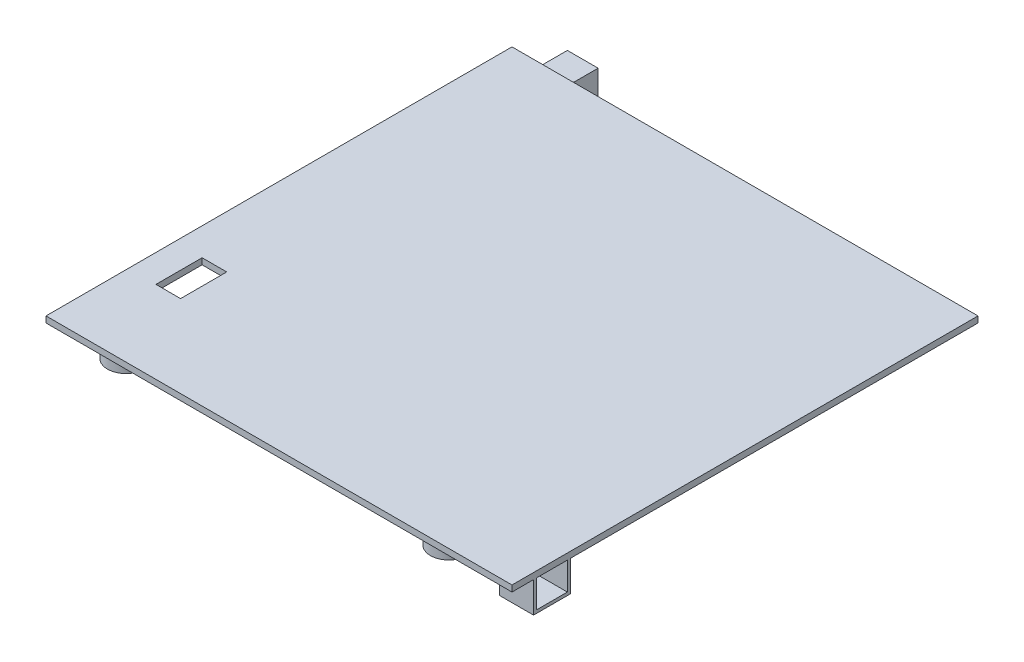
ISO-10303-21;
HEADER;
FILE_DESCRIPTION(('STEP AP214'),'2;1');
FILE_NAME('part.step','',(''),(''),'','','');
FILE_SCHEMA(('AUTOMOTIVE_DESIGN { 1 0 10303 214 1 1 1 1 }'));
ENDSEC;
DATA;
#1=APPLICATION_CONTEXT('core data for automotive mechanical design processes');
#2=APPLICATION_PROTOCOL_DEFINITION('international standard','automotive_design',2000,#1);
#3=PRODUCT_CONTEXT('',#1,'mechanical');
#4=PRODUCT('Part','Part','',(#3));
#5=PRODUCT_RELATED_PRODUCT_CATEGORY('part','',(#4));
#6=PRODUCT_DEFINITION_FORMATION('','',#4);
#7=PRODUCT_DEFINITION_CONTEXT('part definition',#1,'design');
#8=PRODUCT_DEFINITION('design','',#6,#7);
#9=PRODUCT_DEFINITION_SHAPE('','',#8);
#10=(LENGTH_UNIT() NAMED_UNIT(*) SI_UNIT(.MILLI.,.METRE.));
#11=(NAMED_UNIT(*) PLANE_ANGLE_UNIT() SI_UNIT($,.RADIAN.));
#12=(NAMED_UNIT(*) SI_UNIT($,.STERADIAN.) SOLID_ANGLE_UNIT());
#13=UNCERTAINTY_MEASURE_WITH_UNIT(LENGTH_MEASURE(1.E-05),#10,'distance_accuracy_value','');
#14=(GEOMETRIC_REPRESENTATION_CONTEXT(3) GLOBAL_UNCERTAINTY_ASSIGNED_CONTEXT((#13)) GLOBAL_UNIT_ASSIGNED_CONTEXT((#10,
#11,#12)) REPRESENTATION_CONTEXT('',''));
#15=CARTESIAN_POINT('',(0.,0.,0.));
#16=DIRECTION('',(0.,0.,1.));
#17=DIRECTION('',(1.,0.,0.));
#18=AXIS2_PLACEMENT_3D('',#15,#16,#17);
#19=CARTESIAN_POINT('',(0.,0.,0.));
#20=DIRECTION('',(0.,-1.,0.));
#21=DIRECTION('',(0.,0.,-1.));
#22=AXIS2_PLACEMENT_3D('',#19,#20,#21);
#23=PLANE('',#22);
#24=CARTESIAN_POINT('',(118.,0.,-13.));
#25=DIRECTION('',(0.,-1.,0.));
#26=DIRECTION('',(0.,0.,-1.));
#27=AXIS2_PLACEMENT_3D('',#24,#25,#26);
#28=CIRCLE('',#27,6.);
#29=CARTESIAN_POINT('',(118.,0.,-19.));
#30=VERTEX_POINT('',#29);
#31=EDGE_CURVE('E362',#30,#30,#28,.T.);
#32=ORIENTED_EDGE('',*,*,#31,.F.);
#33=EDGE_LOOP('',(#32));
#34=FACE_BOUND('',#33,.T.);
#35=CARTESIAN_POINT('',(13.,0.,-13.));
#36=DIRECTION('',(0.,-1.,0.));
#37=DIRECTION('',(0.,0.,-1.));
#38=AXIS2_PLACEMENT_3D('',#35,#36,#37);
#39=CIRCLE('',#38,6.);
#40=CARTESIAN_POINT('',(13.,0.,-19.));
#41=VERTEX_POINT('',#40);
#42=EDGE_CURVE('E394',#41,#41,#39,.T.);
#43=ORIENTED_EDGE('',*,*,#42,.F.);
#44=EDGE_LOOP('',(#43));
#45=FACE_BOUND('',#44,.T.);
#46=CARTESIAN_POINT('',(13.,0.,-118.));
#47=DIRECTION('',(0.,-1.,0.));
#48=DIRECTION('',(0.,0.,-1.));
#49=AXIS2_PLACEMENT_3D('',#46,#47,#48);
#50=CIRCLE('',#49,6.);
#51=CARTESIAN_POINT('',(13.,0.,-124.));
#52=VERTEX_POINT('',#51);
#53=EDGE_CURVE('E452',#52,#52,#50,.T.);
#54=ORIENTED_EDGE('',*,*,#53,.F.);
#55=EDGE_LOOP('',(#54));
#56=FACE_BOUND('',#55,.T.);
#57=CARTESIAN_POINT('',(118.,0.,-118.));
#58=DIRECTION('',(0.,-1.,0.));
#59=DIRECTION('',(0.,0.,-1.));
#60=AXIS2_PLACEMENT_3D('',#57,#58,#59);
#61=CIRCLE('',#60,6.);
#62=CARTESIAN_POINT('',(118.,0.,-124.));
#63=VERTEX_POINT('',#62);
#64=EDGE_CURVE('E460',#63,#63,#61,.T.);
#65=ORIENTED_EDGE('',*,*,#64,.F.);
#66=EDGE_LOOP('',(#65));
#67=FACE_BOUND('',#66,.T.);
#68=DIRECTION('',(0.,0.,-1.));
#69=VECTOR('',#68,1.);
#70=CARTESIAN_POINT('',(140.5,0.,-7.));
#71=LINE('',#70,#69);
#72=CARTESIAN_POINT('',(140.5,0.,-7.));
#73=VERTEX_POINT('',#72);
#74=CARTESIAN_POINT('',(140.5,0.,-19.));
#75=VERTEX_POINT('',#74);
#76=EDGE_CURVE('E292',#73,#75,#71,.T.);
#77=ORIENTED_EDGE('',*,*,#76,.F.);
#78=DIRECTION('',(-1.,0.,0.));
#79=VECTOR('',#78,1.);
#80=CARTESIAN_POINT('',(140.5,0.,-7.));
#81=LINE('',#80,#79);
#82=CARTESIAN_POINT('',(151.5,0.,-7.));
#83=VERTEX_POINT('',#82);
#84=EDGE_CURVE('E265',#83,#73,#81,.T.);
#85=ORIENTED_EDGE('',*,*,#84,.F.);
#86=DIRECTION('',(0.,0.,-1.));
#87=VECTOR('',#86,1.);
#88=CARTESIAN_POINT('',(151.5,0.,0.));
#89=LINE('',#88,#87);
#90=CARTESIAN_POINT('',(151.5,0.,0.));
#91=VERTEX_POINT('',#90);
#92=EDGE_CURVE('E428',#91,#83,#89,.T.);
#93=ORIENTED_EDGE('',*,*,#92,.F.);
#94=DIRECTION('',(1.,0.,0.));
#95=VECTOR('',#94,1.);
#96=CARTESIAN_POINT('',(0.,0.,0.));
#97=LINE('',#96,#95);
#98=CARTESIAN_POINT('',(0.,0.,0.));
#99=VERTEX_POINT('',#98);
#100=EDGE_CURVE('E424',#99,#91,#97,.T.);
#101=ORIENTED_EDGE('',*,*,#100,.F.);
#102=DIRECTION('',(0.,0.,1.));
#103=VECTOR('',#102,1.);
#104=CARTESIAN_POINT('',(0.,0.,0.));
#105=LINE('',#104,#103);
#106=CARTESIAN_POINT('',(0.,0.,-151.5));
#107=VERTEX_POINT('',#106);
#108=EDGE_CURVE('E402',#107,#99,#105,.T.);
#109=ORIENTED_EDGE('',*,*,#108,.F.);
#110=DIRECTION('',(-1.,0.,0.));
#111=VECTOR('',#110,1.);
#112=CARTESIAN_POINT('',(0.,0.,-151.5));
#113=LINE('',#112,#111);
#114=CARTESIAN_POINT('',(8.,0.,-151.5));
#115=VERTEX_POINT('',#114);
#116=EDGE_CURVE('E432',#115,#107,#113,.T.);
#117=ORIENTED_EDGE('',*,*,#116,.F.);
#118=DIRECTION('',(0.,0.,-1.));
#119=VECTOR('',#118,1.);
#120=CARTESIAN_POINT('',(8.00000000000003,0.,0.));
#121=LINE('',#120,#119);
#122=CARTESIAN_POINT('',(8.,0.,-141.5));
#123=VERTEX_POINT('',#122);
#124=EDGE_CURVE('E11',#123,#115,#121,.T.);
#125=ORIENTED_EDGE('',*,*,#124,.F.);
#126=DIRECTION('',(1.,0.,0.));
#127=VECTOR('',#126,1.);
#128=CARTESIAN_POINT('',(8.,0.,-141.5));
#129=LINE('',#128,#127);
#130=CARTESIAN_POINT('',(18.,0.,-141.5));
#131=VERTEX_POINT('',#130);
#132=EDGE_CURVE('E317',#123,#131,#129,.T.);
#133=ORIENTED_EDGE('',*,*,#132,.T.);
#134=DIRECTION('',(0.,0.,-1.));
#135=VECTOR('',#134,1.);
#136=CARTESIAN_POINT('',(18.,0.,-161.5));
#137=LINE('',#136,#135);
#138=CARTESIAN_POINT('',(18.,0.,-151.5));
#139=VERTEX_POINT('',#138);
#140=EDGE_CURVE('E330',#131,#139,#137,.T.);
#141=ORIENTED_EDGE('',*,*,#140,.T.);
#142=CARTESIAN_POINT('',(151.5,0.,-151.5));
#143=VERTEX_POINT('',#142);
#144=EDGE_CURVE('E411',#143,#139,#113,.T.);
#145=ORIENTED_EDGE('',*,*,#144,.F.);
#146=CARTESIAN_POINT('',(151.5,0.,-19.));
#147=VERTEX_POINT('',#146);
#148=EDGE_CURVE('E427',#147,#143,#89,.T.);
#149=ORIENTED_EDGE('',*,*,#148,.F.);
#150=DIRECTION('',(1.,0.,0.));
#151=VECTOR('',#150,1.);
#152=CARTESIAN_POINT('',(140.5,0.,-19.));
#153=LINE('',#152,#151);
#154=EDGE_CURVE('E280',#75,#147,#153,.T.);
#155=ORIENTED_EDGE('',*,*,#154,.F.);
#156=EDGE_LOOP('',(#77,#85,#93,#101,#109,#117,#125,#133,#141,#145,#149,#155));
#157=FACE_BOUND('',#156,.T.);
#158=DIRECTION('',(1.,0.,0.));
#159=VECTOR('',#158,1.);
#160=CARTESIAN_POINT('',(9.,0.,-26.75));
#161=LINE('',#160,#159);
#162=CARTESIAN_POINT('',(9.,0.,-26.75));
#163=VERTEX_POINT('',#162);
#164=CARTESIAN_POINT('',(17.,0.,-26.75));
#165=VERTEX_POINT('',#164);
#166=EDGE_CURVE('E192',#163,#165,#161,.T.);
#167=ORIENTED_EDGE('',*,*,#166,.T.);
#168=DIRECTION('',(0.,0.,-1.));
#169=VECTOR('',#168,1.);
#170=CARTESIAN_POINT('',(17.,0.,-26.75));
#171=LINE('',#170,#169);
#172=CARTESIAN_POINT('',(17.,0.,-41.75));
#173=VERTEX_POINT('',#172);
#174=EDGE_CURVE('E54',#165,#173,#171,.T.);
#175=ORIENTED_EDGE('',*,*,#174,.T.);
#176=DIRECTION('',(-1.,0.,0.));
#177=VECTOR('',#176,1.);
#178=CARTESIAN_POINT('',(9.,0.,-41.75));
#179=LINE('',#178,#177);
#180=CARTESIAN_POINT('',(9.,0.,-41.75));
#181=VERTEX_POINT('',#180);
#182=EDGE_CURVE('E198',#173,#181,#179,.T.);
#183=ORIENTED_EDGE('',*,*,#182,.T.);
#184=DIRECTION('',(0.,0.,1.));
#185=VECTOR('',#184,1.);
#186=CARTESIAN_POINT('',(9.,0.,-26.75));
#187=LINE('',#186,#185);
#188=EDGE_CURVE('E218',#181,#163,#187,.T.);
#189=ORIENTED_EDGE('',*,*,#188,.T.);
#190=EDGE_LOOP('',(#167,#175,#183,#189));
#191=FACE_BOUND('',#190,.T.);
#192=ADVANCED_FACE('F38',(#34,#45,#56,#67,#157,#191),#23,.T.);
#193=CARTESIAN_POINT('',(0.,2.,0.));
#194=DIRECTION('',(0.,-1.,0.));
#195=DIRECTION('',(0.,0.,-1.));
#196=AXIS2_PLACEMENT_3D('',#193,#194,#195);
#197=PLANE('',#196);
#198=DIRECTION('',(0.,0.,1.));
#199=VECTOR('',#198,1.);
#200=CARTESIAN_POINT('',(0.,2.,0.));
#201=LINE('',#200,#199);
#202=CARTESIAN_POINT('',(0.,2.,-151.5));
#203=VERTEX_POINT('',#202);
#204=CARTESIAN_POINT('',(0.,2.,0.));
#205=VERTEX_POINT('',#204);
#206=EDGE_CURVE('E406',#203,#205,#201,.T.);
#207=ORIENTED_EDGE('',*,*,#206,.T.);
#208=DIRECTION('',(1.,0.,0.));
#209=VECTOR('',#208,1.);
#210=CARTESIAN_POINT('',(0.,2.,0.));
#211=LINE('',#210,#209);
#212=CARTESIAN_POINT('',(151.5,2.,0.));
#213=VERTEX_POINT('',#212);
#214=EDGE_CURVE('E410',#205,#213,#211,.T.);
#215=ORIENTED_EDGE('',*,*,#214,.T.);
#216=DIRECTION('',(0.,0.,-1.));
#217=VECTOR('',#216,1.);
#218=CARTESIAN_POINT('',(151.5,2.,0.));
#219=LINE('',#218,#217);
#220=CARTESIAN_POINT('',(151.5,2.,-151.5));
#221=VERTEX_POINT('',#220);
#222=EDGE_CURVE('E414',#213,#221,#219,.T.);
#223=ORIENTED_EDGE('',*,*,#222,.T.);
#224=DIRECTION('',(-1.,0.,0.));
#225=VECTOR('',#224,1.);
#226=CARTESIAN_POINT('',(0.,2.,-151.5));
#227=LINE('',#226,#225);
#228=EDGE_CURVE('E417',#221,#203,#227,.T.);
#229=ORIENTED_EDGE('',*,*,#228,.T.);
#230=EDGE_LOOP('',(#207,#215,#223,#229));
#231=FACE_BOUND('',#230,.T.);
#232=DIRECTION('',(0.,0.,-1.));
#233=VECTOR('',#232,1.);
#234=CARTESIAN_POINT('',(17.,2.,-26.75));
#235=LINE('',#234,#233);
#236=CARTESIAN_POINT('',(17.,2.,-26.75));
#237=VERTEX_POINT('',#236);
#238=CARTESIAN_POINT('',(17.,2.,-41.75));
#239=VERTEX_POINT('',#238);
#240=EDGE_CURVE('E182',#237,#239,#235,.T.);
#241=ORIENTED_EDGE('',*,*,#240,.F.);
#242=DIRECTION('',(1.,0.,0.));
#243=VECTOR('',#242,1.);
#244=CARTESIAN_POINT('',(9.,2.,-26.75));
#245=LINE('',#244,#243);
#246=CARTESIAN_POINT('',(9.,2.,-26.75));
#247=VERTEX_POINT('',#246);
#248=EDGE_CURVE('E209',#247,#237,#245,.T.);
#249=ORIENTED_EDGE('',*,*,#248,.F.);
#250=DIRECTION('',(0.,0.,1.));
#251=VECTOR('',#250,1.);
#252=CARTESIAN_POINT('',(9.,2.,-26.75));
#253=LINE('',#252,#251);
#254=CARTESIAN_POINT('',(9.,2.,-41.75));
#255=VERTEX_POINT('',#254);
#256=EDGE_CURVE('E205',#255,#247,#253,.T.);
#257=ORIENTED_EDGE('',*,*,#256,.F.);
#258=DIRECTION('',(-1.,0.,0.));
#259=VECTOR('',#258,1.);
#260=CARTESIAN_POINT('',(9.,2.,-41.75));
#261=LINE('',#260,#259);
#262=EDGE_CURVE('E191',#239,#255,#261,.T.);
#263=ORIENTED_EDGE('',*,*,#262,.F.);
#264=EDGE_LOOP('',(#241,#249,#257,#263));
#265=FACE_BOUND('',#264,.T.);
#266=ADVANCED_FACE('F204',(#231,#265),#197,.F.);
#267=CARTESIAN_POINT('',(118.,-10.,-118.));
#268=DIRECTION('',(0.,-1.,0.));
#269=DIRECTION('',(0.,0.,-1.));
#270=AXIS2_PLACEMENT_3D('',#267,#268,#269);
#271=PLANE('',#270);
#272=CARTESIAN_POINT('',(118.,-10.,-118.));
#273=DIRECTION('',(0.,1.,0.));
#274=DIRECTION('',(0.,0.,1.));
#275=AXIS2_PLACEMENT_3D('',#272,#273,#274);
#276=CIRCLE('',#275,5.);
#277=CARTESIAN_POINT('',(118.,-10.,-113.));
#278=VERTEX_POINT('',#277);
#279=EDGE_CURVE('E375',#278,#278,#276,.T.);
#280=ORIENTED_EDGE('',*,*,#279,.T.);
#281=EDGE_LOOP('',(#280));
#282=FACE_BOUND('',#281,.T.);
#283=CARTESIAN_POINT('',(118.,-10.,-118.));
#284=DIRECTION('',(0.,-1.,0.));
#285=DIRECTION('',(0.,0.,-1.));
#286=AXIS2_PLACEMENT_3D('',#283,#284,#285);
#287=CIRCLE('',#286,6.);
#288=CARTESIAN_POINT('',(118.,-10.,-124.));
#289=VERTEX_POINT('',#288);
#290=EDGE_CURVE('E47',#289,#289,#287,.T.);
#291=ORIENTED_EDGE('',*,*,#290,.T.);
#292=EDGE_LOOP('',(#291));
#293=FACE_BOUND('',#292,.T.);
#294=ADVANCED_FACE('F40',(#282,#293),#271,.T.);
#295=CARTESIAN_POINT('',(118.,-10.,-118.));
#296=DIRECTION('',(0.,1.,0.));
#297=DIRECTION('',(0.,0.,1.));
#298=AXIS2_PLACEMENT_3D('',#295,#296,#297);
#299=CYLINDRICAL_SURFACE('',#298,6.);
#300=ORIENTED_EDGE('',*,*,#290,.F.);
#301=EDGE_LOOP('',(#300));
#302=FACE_BOUND('',#301,.T.);
#303=ORIENTED_EDGE('',*,*,#64,.T.);
#304=EDGE_LOOP('',(#303));
#305=FACE_BOUND('',#304,.T.);
#306=ADVANCED_FACE('F468',(#302,#305),#299,.T.);
#307=CARTESIAN_POINT('',(13.,-10.,-118.));
#308=DIRECTION('',(0.,-1.,0.));
#309=DIRECTION('',(0.,0.,-1.));
#310=AXIS2_PLACEMENT_3D('',#307,#308,#309);
#311=PLANE('',#310);
#312=CARTESIAN_POINT('',(13.,-10.,-118.));
#313=DIRECTION('',(0.,1.,0.));
#314=DIRECTION('',(0.,0.,1.));
#315=AXIS2_PLACEMENT_3D('',#312,#313,#314);
#316=CIRCLE('',#315,5.);
#317=CARTESIAN_POINT('',(13.,-10.,-113.));
#318=VERTEX_POINT('',#317);
#319=EDGE_CURVE('E358',#318,#318,#316,.T.);
#320=ORIENTED_EDGE('',*,*,#319,.T.);
#321=EDGE_LOOP('',(#320));
#322=FACE_BOUND('',#321,.T.);
#323=CARTESIAN_POINT('',(13.,-10.,-118.));
#324=DIRECTION('',(0.,-1.,0.));
#325=DIRECTION('',(0.,0.,-1.));
#326=AXIS2_PLACEMENT_3D('',#323,#324,#325);
#327=CIRCLE('',#326,6.);
#328=CARTESIAN_POINT('',(13.,-10.,-124.));
#329=VERTEX_POINT('',#328);
#330=EDGE_CURVE('E456',#329,#329,#327,.T.);
#331=ORIENTED_EDGE('',*,*,#330,.T.);
#332=EDGE_LOOP('',(#331));
#333=FACE_BOUND('',#332,.T.);
#334=ADVANCED_FACE('F471',(#322,#333),#311,.T.);
#335=CARTESIAN_POINT('',(13.,-10.,-118.));
#336=DIRECTION('',(0.,1.,0.));
#337=DIRECTION('',(0.,0.,1.));
#338=AXIS2_PLACEMENT_3D('',#335,#336,#337);
#339=CYLINDRICAL_SURFACE('',#338,6.);
#340=ORIENTED_EDGE('',*,*,#330,.F.);
#341=EDGE_LOOP('',(#340));
#342=FACE_BOUND('',#341,.T.);
#343=ORIENTED_EDGE('',*,*,#53,.T.);
#344=EDGE_LOOP('',(#343));
#345=FACE_BOUND('',#344,.T.);
#346=ADVANCED_FACE('F623',(#342,#345),#339,.T.);
#347=CARTESIAN_POINT('',(0.,2.,0.));
#348=DIRECTION('',(1.,0.,0.));
#349=DIRECTION('',(0.,0.,-1.));
#350=AXIS2_PLACEMENT_3D('',#347,#348,#349);
#351=PLANE('',#350);
#352=ORIENTED_EDGE('',*,*,#108,.T.);
#353=DIRECTION('',(0.,-1.,0.));
#354=VECTOR('',#353,1.);
#355=CARTESIAN_POINT('',(0.,2.,0.));
#356=LINE('',#355,#354);
#357=EDGE_CURVE('E448',#205,#99,#356,.T.);
#358=ORIENTED_EDGE('',*,*,#357,.F.);
#359=ORIENTED_EDGE('',*,*,#206,.F.);
#360=DIRECTION('',(0.,-1.,0.));
#361=VECTOR('',#360,1.);
#362=CARTESIAN_POINT('',(0.,2.,-151.5));
#363=LINE('',#362,#361);
#364=EDGE_CURVE('E420',#203,#107,#363,.T.);
#365=ORIENTED_EDGE('',*,*,#364,.T.);
#366=EDGE_LOOP('',(#352,#358,#359,#365));
#367=FACE_BOUND('',#366,.T.);
#368=ADVANCED_FACE('F619',(#367),#351,.F.);
#369=CARTESIAN_POINT('',(0.,2.,0.));
#370=DIRECTION('',(0.,0.,-1.));
#371=DIRECTION('',(-1.,0.,0.));
#372=AXIS2_PLACEMENT_3D('',#369,#370,#371);
#373=PLANE('',#372);
#374=ORIENTED_EDGE('',*,*,#100,.T.);
#375=DIRECTION('',(0.,-1.,0.));
#376=VECTOR('',#375,1.);
#377=CARTESIAN_POINT('',(151.5,2.,0.));
#378=LINE('',#377,#376);
#379=EDGE_CURVE('E444',#213,#91,#378,.T.);
#380=ORIENTED_EDGE('',*,*,#379,.F.);
#381=ORIENTED_EDGE('',*,*,#214,.F.);
#382=ORIENTED_EDGE('',*,*,#357,.T.);
#383=EDGE_LOOP('',(#374,#380,#381,#382));
#384=FACE_BOUND('',#383,.T.);
#385=ADVANCED_FACE('F615',(#384),#373,.F.);
#386=CARTESIAN_POINT('',(151.5,2.,0.));
#387=DIRECTION('',(-1.,0.,0.));
#388=DIRECTION('',(0.,0.,1.));
#389=AXIS2_PLACEMENT_3D('',#386,#387,#388);
#390=PLANE('',#389);
#391=DIRECTION('',(0.,0.,1.));
#392=VECTOR('',#391,1.);
#393=CARTESIAN_POINT('',(151.5,0.,-8.));
#394=LINE('',#393,#392);
#395=CARTESIAN_POINT('',(151.5,0.,-18.));
#396=VERTEX_POINT('',#395);
#397=CARTESIAN_POINT('',(151.5,0.,-8.));
#398=VERTEX_POINT('',#397);
#399=EDGE_CURVE('E251',#396,#398,#394,.T.);
#400=ORIENTED_EDGE('',*,*,#399,.F.);
#401=DIRECTION('',(0.,1.,0.));
#402=VECTOR('',#401,1.);
#403=CARTESIAN_POINT('',(151.5,0.,-18.));
#404=LINE('',#403,#402);
#405=CARTESIAN_POINT('',(151.5,-9.,-18.));
#406=VERTEX_POINT('',#405);
#407=EDGE_CURVE('E200',#406,#396,#404,.T.);
#408=ORIENTED_EDGE('',*,*,#407,.F.);
#409=DIRECTION('',(0.,0.,-1.));
#410=VECTOR('',#409,1.);
#411=CARTESIAN_POINT('',(151.5,-9.,-8.));
#412=LINE('',#411,#410);
#413=CARTESIAN_POINT('',(151.5,-9.,-8.));
#414=VERTEX_POINT('',#413);
#415=EDGE_CURVE('E236',#414,#406,#412,.T.);
#416=ORIENTED_EDGE('',*,*,#415,.F.);
#417=DIRECTION('',(0.,-1.,0.));
#418=VECTOR('',#417,1.);
#419=CARTESIAN_POINT('',(151.5,0.,-8.));
#420=LINE('',#419,#418);
#421=EDGE_CURVE('E255',#398,#414,#420,.T.);
#422=ORIENTED_EDGE('',*,*,#421,.F.);
#423=EDGE_LOOP('',(#400,#408,#416,#422));
#424=FACE_BOUND('',#423,.T.);
#425=ORIENTED_EDGE('',*,*,#92,.T.);
#426=DIRECTION('',(0.,1.,0.));
#427=VECTOR('',#426,1.);
#428=CARTESIAN_POINT('',(151.5,-10.,-7.));
#429=LINE('',#428,#427);
#430=CARTESIAN_POINT('',(151.5,-10.,-7.));
#431=VERTEX_POINT('',#430);
#432=EDGE_CURVE('E308',#431,#83,#429,.T.);
#433=ORIENTED_EDGE('',*,*,#432,.F.);
#434=DIRECTION('',(0.,0.,1.));
#435=VECTOR('',#434,1.);
#436=CARTESIAN_POINT('',(151.5,-10.,-7.));
#437=LINE('',#436,#435);
#438=CARTESIAN_POINT('',(151.5,-10.,-19.));
#439=VERTEX_POINT('',#438);
#440=EDGE_CURVE('E275',#439,#431,#437,.T.);
#441=ORIENTED_EDGE('',*,*,#440,.F.);
#442=DIRECTION('',(0.,1.,0.));
#443=VECTOR('',#442,1.);
#444=CARTESIAN_POINT('',(151.5,-10.,-19.));
#445=LINE('',#444,#443);
#446=EDGE_CURVE('E289',#439,#147,#445,.T.);
#447=ORIENTED_EDGE('',*,*,#446,.T.);
#448=ORIENTED_EDGE('',*,*,#148,.T.);
#449=DIRECTION('',(0.,-1.,0.));
#450=VECTOR('',#449,1.);
#451=CARTESIAN_POINT('',(151.5,2.,-151.5));
#452=LINE('',#451,#450);
#453=EDGE_CURVE('E440',#221,#143,#452,.T.);
#454=ORIENTED_EDGE('',*,*,#453,.F.);
#455=ORIENTED_EDGE('',*,*,#222,.F.);
#456=ORIENTED_EDGE('',*,*,#379,.T.);
#457=EDGE_LOOP('',(#425,#433,#441,#447,#448,#454,#455,#456));
#458=FACE_BOUND('',#457,.T.);
#459=ADVANCED_FACE('F611',(#424,#458),#390,.F.);
#460=CARTESIAN_POINT('',(0.,2.,-151.5));
#461=DIRECTION('',(0.,0.,1.));
#462=DIRECTION('',(1.,0.,0.));
#463=AXIS2_PLACEMENT_3D('',#460,#461,#462);
#464=PLANE('',#463);
#465=ORIENTED_EDGE('',*,*,#144,.T.);
#466=EDGE_CURVE('E436',#139,#115,#113,.T.);
#467=ORIENTED_EDGE('',*,*,#466,.T.);
#468=ORIENTED_EDGE('',*,*,#116,.T.);
#469=ORIENTED_EDGE('',*,*,#364,.F.);
#470=ORIENTED_EDGE('',*,*,#228,.F.);
#471=ORIENTED_EDGE('',*,*,#453,.T.);
#472=EDGE_LOOP('',(#465,#467,#468,#469,#470,#471));
#473=FACE_BOUND('',#472,.T.);
#474=ADVANCED_FACE('F604',(#473),#464,.F.);
#475=CARTESIAN_POINT('',(13.,-10.,-13.));
#476=DIRECTION('',(0.,1.,0.));
#477=DIRECTION('',(0.,0.,1.));
#478=AXIS2_PLACEMENT_3D('',#475,#476,#477);
#479=CYLINDRICAL_SURFACE('',#478,6.);
#480=CARTESIAN_POINT('',(13.,-10.,-13.));
#481=DIRECTION('',(0.,-1.,0.));
#482=DIRECTION('',(0.,0.,-1.));
#483=AXIS2_PLACEMENT_3D('',#480,#481,#482);
#484=CIRCLE('',#483,6.);
#485=CARTESIAN_POINT('',(13.,-10.,-19.));
#486=VERTEX_POINT('',#485);
#487=EDGE_CURVE('E398',#486,#486,#484,.T.);
#488=ORIENTED_EDGE('',*,*,#487,.F.);
#489=EDGE_LOOP('',(#488));
#490=FACE_BOUND('',#489,.T.);
#491=ORIENTED_EDGE('',*,*,#42,.T.);
#492=EDGE_LOOP('',(#491));
#493=FACE_BOUND('',#492,.T.);
#494=ADVANCED_FACE('F600',(#490,#493),#479,.T.);
#495=CARTESIAN_POINT('',(13.,-10.,-13.));
#496=DIRECTION('',(0.,-1.,0.));
#497=DIRECTION('',(0.,0.,-1.));
#498=AXIS2_PLACEMENT_3D('',#495,#496,#497);
#499=PLANE('',#498);
#500=CARTESIAN_POINT('',(13.,-10.,-13.));
#501=DIRECTION('',(0.,1.,0.));
#502=DIRECTION('',(0.,0.,1.));
#503=AXIS2_PLACEMENT_3D('',#500,#501,#502);
#504=CIRCLE('',#503,5.);
#505=CARTESIAN_POINT('',(13.,-10.,-8.));
#506=VERTEX_POINT('',#505);
#507=EDGE_CURVE('E390',#506,#506,#504,.T.);
#508=ORIENTED_EDGE('',*,*,#507,.T.);
#509=EDGE_LOOP('',(#508));
#510=FACE_BOUND('',#509,.T.);
#511=ORIENTED_EDGE('',*,*,#487,.T.);
#512=EDGE_LOOP('',(#511));
#513=FACE_BOUND('',#512,.T.);
#514=ADVANCED_FACE('F596',(#510,#513),#499,.T.);
#515=CARTESIAN_POINT('',(13.,-10.,-13.));
#516=DIRECTION('',(0.,1.,0.));
#517=DIRECTION('',(0.,0.,1.));
#518=AXIS2_PLACEMENT_3D('',#515,#516,#517);
#519=CYLINDRICAL_SURFACE('',#518,5.);
#520=ORIENTED_EDGE('',*,*,#507,.F.);
#521=EDGE_LOOP('',(#520));
#522=FACE_BOUND('',#521,.T.);
#523=CARTESIAN_POINT('',(13.,0.,-13.));
#524=DIRECTION('',(0.,1.,0.));
#525=DIRECTION('',(0.,0.,1.));
#526=AXIS2_PLACEMENT_3D('',#523,#524,#525);
#527=CIRCLE('',#526,5.);
#528=CARTESIAN_POINT('',(13.,0.,-8.));
#529=VERTEX_POINT('',#528);
#530=EDGE_CURVE('E389',#529,#529,#527,.T.);
#531=ORIENTED_EDGE('',*,*,#530,.T.);
#532=EDGE_LOOP('',(#531));
#533=FACE_BOUND('',#532,.T.);
#534=ADVANCED_FACE('F592',(#522,#533),#519,.F.);
#535=CARTESIAN_POINT('',(13.,0.,-13.));
#536=DIRECTION('',(0.,1.,0.));
#537=DIRECTION('',(0.,0.,1.));
#538=AXIS2_PLACEMENT_3D('',#535,#536,#537);
#539=PLANE('',#538);
#540=ORIENTED_EDGE('',*,*,#530,.F.);
#541=EDGE_LOOP('',(#540));
#542=FACE_BOUND('',#541,.T.);
#543=ADVANCED_FACE('F588',(#542),#539,.F.);
#544=CARTESIAN_POINT('',(118.,-10.,-13.));
#545=DIRECTION('',(0.,1.,0.));
#546=DIRECTION('',(0.,0.,1.));
#547=AXIS2_PLACEMENT_3D('',#544,#545,#546);
#548=CYLINDRICAL_SURFACE('',#547,6.);
#549=CARTESIAN_POINT('',(118.,-10.,-13.));
#550=DIRECTION('',(0.,-1.,0.));
#551=DIRECTION('',(0.,0.,-1.));
#552=AXIS2_PLACEMENT_3D('',#549,#550,#551);
#553=CIRCLE('',#552,6.);
#554=CARTESIAN_POINT('',(118.,-10.,-19.));
#555=VERTEX_POINT('',#554);
#556=EDGE_CURVE('E385',#555,#555,#553,.T.);
#557=ORIENTED_EDGE('',*,*,#556,.F.);
#558=EDGE_LOOP('',(#557));
#559=FACE_BOUND('',#558,.T.);
#560=ORIENTED_EDGE('',*,*,#31,.T.);
#561=EDGE_LOOP('',(#560));
#562=FACE_BOUND('',#561,.T.);
#563=ADVANCED_FACE('F584',(#559,#562),#548,.T.);
#564=CARTESIAN_POINT('',(118.,-10.,-13.));
#565=DIRECTION('',(0.,-1.,0.));
#566=DIRECTION('',(0.,0.,-1.));
#567=AXIS2_PLACEMENT_3D('',#564,#565,#566);
#568=PLANE('',#567);
#569=CARTESIAN_POINT('',(118.,-10.,-13.));
#570=DIRECTION('',(0.,1.,0.));
#571=DIRECTION('',(0.,0.,1.));
#572=AXIS2_PLACEMENT_3D('',#569,#570,#571);
#573=CIRCLE('',#572,5.);
#574=CARTESIAN_POINT('',(118.,-10.,-8.));
#575=VERTEX_POINT('',#574);
#576=EDGE_CURVE('E367',#575,#575,#573,.T.);
#577=ORIENTED_EDGE('',*,*,#576,.T.);
#578=EDGE_LOOP('',(#577));
#579=FACE_BOUND('',#578,.T.);
#580=ORIENTED_EDGE('',*,*,#556,.T.);
#581=EDGE_LOOP('',(#580));
#582=FACE_BOUND('',#581,.T.);
#583=ADVANCED_FACE('F574',(#579,#582),#568,.T.);
#584=CARTESIAN_POINT('',(118.,-10.,-13.));
#585=DIRECTION('',(0.,1.,0.));
#586=DIRECTION('',(0.,0.,1.));
#587=AXIS2_PLACEMENT_3D('',#584,#585,#586);
#588=CYLINDRICAL_SURFACE('',#587,5.);
#589=ORIENTED_EDGE('',*,*,#576,.F.);
#590=EDGE_LOOP('',(#589));
#591=FACE_BOUND('',#590,.T.);
#592=CARTESIAN_POINT('',(118.,0.,-13.));
#593=DIRECTION('',(0.,1.,0.));
#594=DIRECTION('',(0.,0.,1.));
#595=AXIS2_PLACEMENT_3D('',#592,#593,#594);
#596=CIRCLE('',#595,5.);
#597=CARTESIAN_POINT('',(118.,0.,-8.));
#598=VERTEX_POINT('',#597);
#599=EDGE_CURVE('E371',#598,#598,#596,.T.);
#600=ORIENTED_EDGE('',*,*,#599,.T.);
#601=EDGE_LOOP('',(#600));
#602=FACE_BOUND('',#601,.T.);
#603=ADVANCED_FACE('F570',(#591,#602),#588,.F.);
#604=CARTESIAN_POINT('',(118.,0.,-13.));
#605=DIRECTION('',(0.,1.,0.));
#606=DIRECTION('',(0.,0.,1.));
#607=AXIS2_PLACEMENT_3D('',#604,#605,#606);
#608=PLANE('',#607);
#609=ORIENTED_EDGE('',*,*,#599,.F.);
#610=EDGE_LOOP('',(#609));
#611=FACE_BOUND('',#610,.T.);
#612=ADVANCED_FACE('F566',(#611),#608,.F.);
#613=CARTESIAN_POINT('',(13.,-10.,-118.));
#614=DIRECTION('',(0.,1.,0.));
#615=DIRECTION('',(0.,0.,1.));
#616=AXIS2_PLACEMENT_3D('',#613,#614,#615);
#617=CYLINDRICAL_SURFACE('',#616,5.);
#618=ORIENTED_EDGE('',*,*,#319,.F.);
#619=EDGE_LOOP('',(#618));
#620=FACE_BOUND('',#619,.T.);
#621=CARTESIAN_POINT('',(13.,0.,-118.));
#622=DIRECTION('',(0.,1.,0.));
#623=DIRECTION('',(0.,0.,1.));
#624=AXIS2_PLACEMENT_3D('',#621,#622,#623);
#625=CIRCLE('',#624,5.);
#626=CARTESIAN_POINT('',(13.,0.,-113.));
#627=VERTEX_POINT('',#626);
#628=EDGE_CURVE('E363',#627,#627,#625,.T.);
#629=ORIENTED_EDGE('',*,*,#628,.T.);
#630=EDGE_LOOP('',(#629));
#631=FACE_BOUND('',#630,.T.);
#632=ADVANCED_FACE('F562',(#620,#631),#617,.F.);
#633=CARTESIAN_POINT('',(13.,0.,-118.));
#634=DIRECTION('',(0.,1.,0.));
#635=DIRECTION('',(0.,0.,1.));
#636=AXIS2_PLACEMENT_3D('',#633,#634,#635);
#637=PLANE('',#636);
#638=ORIENTED_EDGE('',*,*,#628,.F.);
#639=EDGE_LOOP('',(#638));
#640=FACE_BOUND('',#639,.T.);
#641=ADVANCED_FACE('F558',(#640),#637,.F.);
#642=CARTESIAN_POINT('',(118.,-10.,-118.));
#643=DIRECTION('',(0.,1.,0.));
#644=DIRECTION('',(0.,0.,1.));
#645=AXIS2_PLACEMENT_3D('',#642,#643,#644);
#646=CYLINDRICAL_SURFACE('',#645,5.);
#647=ORIENTED_EDGE('',*,*,#279,.F.);
#648=EDGE_LOOP('',(#647));
#649=FACE_BOUND('',#648,.T.);
#650=CARTESIAN_POINT('',(118.,0.,-118.));
#651=DIRECTION('',(0.,1.,0.));
#652=DIRECTION('',(0.,0.,1.));
#653=AXIS2_PLACEMENT_3D('',#650,#651,#652);
#654=CIRCLE('',#653,5.);
#655=CARTESIAN_POINT('',(118.,0.,-113.));
#656=VERTEX_POINT('',#655);
#657=EDGE_CURVE('E347',#656,#656,#654,.T.);
#658=ORIENTED_EDGE('',*,*,#657,.T.);
#659=EDGE_LOOP('',(#658));
#660=FACE_BOUND('',#659,.T.);
#661=ADVANCED_FACE('F561',(#649,#660),#646,.F.);
#662=CARTESIAN_POINT('',(118.,0.,-118.));
#663=DIRECTION('',(0.,1.,0.));
#664=DIRECTION('',(0.,0.,1.));
#665=AXIS2_PLACEMENT_3D('',#662,#663,#664);
#666=PLANE('',#665);
#667=ORIENTED_EDGE('',*,*,#657,.F.);
#668=EDGE_LOOP('',(#667));
#669=FACE_BOUND('',#668,.T.);
#670=ADVANCED_FACE('F542',(#669),#666,.F.);
#671=CARTESIAN_POINT('',(0.,0.,0.));
#672=DIRECTION('',(0.,1.,0.));
#673=DIRECTION('',(0.,0.,1.));
#674=AXIS2_PLACEMENT_3D('',#671,#672,#673);
#675=PLANE('',#674);
#676=ORIENTED_EDGE('',*,*,#466,.F.);
#677=CARTESIAN_POINT('',(18.,0.,-161.5));
#678=VERTEX_POINT('',#677);
#679=EDGE_CURVE('E311',#139,#678,#137,.T.);
#680=ORIENTED_EDGE('',*,*,#679,.T.);
#681=DIRECTION('',(-1.,0.,0.));
#682=VECTOR('',#681,1.);
#683=CARTESIAN_POINT('',(8.,0.,-161.5));
#684=LINE('',#683,#682);
#685=CARTESIAN_POINT('',(8.,0.,-161.5));
#686=VERTEX_POINT('',#685);
#687=EDGE_CURVE('E333',#678,#686,#684,.T.);
#688=ORIENTED_EDGE('',*,*,#687,.T.);
#689=DIRECTION('',(0.,0.,1.));
#690=VECTOR('',#689,1.);
#691=CARTESIAN_POINT('',(8.,0.,-161.5));
#692=LINE('',#691,#690);
#693=EDGE_CURVE('E337',#686,#115,#692,.T.);
#694=ORIENTED_EDGE('',*,*,#693,.T.);
#695=EDGE_LOOP('',(#676,#680,#688,#694));
#696=FACE_BOUND('',#695,.T.);
#697=ADVANCED_FACE('F538',(#696),#675,.T.);
#698=CARTESIAN_POINT('',(18.,-9.,-161.5));
#699=DIRECTION('',(1.,0.,0.));
#700=DIRECTION('',(0.,0.,-1.));
#701=AXIS2_PLACEMENT_3D('',#698,#699,#700);
#702=PLANE('',#701);
#703=ORIENTED_EDGE('',*,*,#140,.F.);
#704=DIRECTION('',(0.,1.,0.));
#705=VECTOR('',#704,1.);
#706=CARTESIAN_POINT('',(18.,-9.,-141.5));
#707=LINE('',#706,#705);
#708=CARTESIAN_POINT('',(18.,-9.,-141.5));
#709=VERTEX_POINT('',#708);
#710=EDGE_CURVE('E343',#709,#131,#707,.T.);
#711=ORIENTED_EDGE('',*,*,#710,.F.);
#712=DIRECTION('',(0.,0.,-1.));
#713=VECTOR('',#712,1.);
#714=CARTESIAN_POINT('',(18.,-9.,-161.5));
#715=LINE('',#714,#713);
#716=CARTESIAN_POINT('',(18.,-9.,-161.5));
#717=VERTEX_POINT('',#716);
#718=EDGE_CURVE('E312',#709,#717,#715,.T.);
#719=ORIENTED_EDGE('',*,*,#718,.T.);
#720=DIRECTION('',(0.,1.,0.));
#721=VECTOR('',#720,1.);
#722=CARTESIAN_POINT('',(18.,-9.,-161.5));
#723=LINE('',#722,#721);
#724=EDGE_CURVE('E329',#717,#678,#723,.T.);
#725=ORIENTED_EDGE('',*,*,#724,.T.);
#726=ORIENTED_EDGE('',*,*,#679,.F.);
#727=EDGE_LOOP('',(#703,#711,#719,#725,#726));
#728=FACE_BOUND('',#727,.T.);
#729=ADVANCED_FACE('F541',(#728),#702,.T.);
#730=CARTESIAN_POINT('',(8.,-9.,-141.5));
#731=DIRECTION('',(0.,0.,1.));
#732=DIRECTION('',(1.,0.,0.));
#733=AXIS2_PLACEMENT_3D('',#730,#731,#732);
#734=PLANE('',#733);
#735=ORIENTED_EDGE('',*,*,#132,.F.);
#736=DIRECTION('',(0.,1.,0.));
#737=VECTOR('',#736,1.);
#738=CARTESIAN_POINT('',(8.,-9.,-141.5));
#739=LINE('',#738,#737);
#740=CARTESIAN_POINT('',(8.,-9.,-141.5));
#741=VERTEX_POINT('',#740);
#742=EDGE_CURVE('E348',#741,#123,#739,.T.);
#743=ORIENTED_EDGE('',*,*,#742,.F.);
#744=DIRECTION('',(1.,0.,0.));
#745=VECTOR('',#744,1.);
#746=CARTESIAN_POINT('',(8.,-9.,-141.5));
#747=LINE('',#746,#745);
#748=EDGE_CURVE('E325',#741,#709,#747,.T.);
#749=ORIENTED_EDGE('',*,*,#748,.T.);
#750=ORIENTED_EDGE('',*,*,#710,.T.);
#751=EDGE_LOOP('',(#735,#743,#749,#750));
#752=FACE_BOUND('',#751,.T.);
#753=ADVANCED_FACE('F544',(#752),#734,.T.);
#754=CARTESIAN_POINT('',(8.,-9.,-161.5));
#755=DIRECTION('',(-1.,0.,0.));
#756=DIRECTION('',(0.,0.,1.));
#757=AXIS2_PLACEMENT_3D('',#754,#755,#756);
#758=PLANE('',#757);
#759=ORIENTED_EDGE('',*,*,#693,.F.);
#760=DIRECTION('',(0.,1.,0.));
#761=VECTOR('',#760,1.);
#762=CARTESIAN_POINT('',(8.,-9.,-161.5));
#763=LINE('',#762,#761);
#764=CARTESIAN_POINT('',(8.,-9.,-161.5));
#765=VERTEX_POINT('',#764);
#766=EDGE_CURVE('E352',#765,#686,#763,.T.);
#767=ORIENTED_EDGE('',*,*,#766,.F.);
#768=DIRECTION('',(0.,0.,1.));
#769=VECTOR('',#768,1.);
#770=CARTESIAN_POINT('',(8.,-9.,-161.5));
#771=LINE('',#770,#769);
#772=EDGE_CURVE('E321',#765,#741,#771,.T.);
#773=ORIENTED_EDGE('',*,*,#772,.T.);
#774=ORIENTED_EDGE('',*,*,#742,.T.);
#775=ORIENTED_EDGE('',*,*,#124,.T.);
#776=EDGE_LOOP('',(#759,#767,#773,#774,#775));
#777=FACE_BOUND('',#776,.T.);
#778=ADVANCED_FACE('F547',(#777),#758,.T.);
#779=CARTESIAN_POINT('',(8.,-9.,-161.5));
#780=DIRECTION('',(0.,0.,-1.));
#781=DIRECTION('',(-1.,0.,0.));
#782=AXIS2_PLACEMENT_3D('',#779,#780,#781);
#783=PLANE('',#782);
#784=ORIENTED_EDGE('',*,*,#687,.F.);
#785=ORIENTED_EDGE('',*,*,#724,.F.);
#786=DIRECTION('',(-1.,0.,0.));
#787=VECTOR('',#786,1.);
#788=CARTESIAN_POINT('',(8.,-9.,-161.5));
#789=LINE('',#788,#787);
#790=EDGE_CURVE('E316',#717,#765,#789,.T.);
#791=ORIENTED_EDGE('',*,*,#790,.T.);
#792=ORIENTED_EDGE('',*,*,#766,.T.);
#793=EDGE_LOOP('',(#784,#785,#791,#792));
#794=FACE_BOUND('',#793,.T.);
#795=ADVANCED_FACE('F536',(#794),#783,.T.);
#796=CARTESIAN_POINT('',(0.,-9.,0.));
#797=DIRECTION('',(0.,1.,0.));
#798=DIRECTION('',(0.,0.,1.));
#799=AXIS2_PLACEMENT_3D('',#796,#797,#798);
#800=PLANE('',#799);
#801=ORIENTED_EDGE('',*,*,#718,.F.);
#802=ORIENTED_EDGE('',*,*,#748,.F.);
#803=ORIENTED_EDGE('',*,*,#772,.F.);
#804=ORIENTED_EDGE('',*,*,#790,.F.);
#805=EDGE_LOOP('',(#801,#802,#803,#804));
#806=FACE_BOUND('',#805,.T.);
#807=ADVANCED_FACE('F532',(#806),#800,.F.);
#808=CARTESIAN_POINT('',(140.5,-10.,-7.));
#809=DIRECTION('',(0.,0.,-1.));
#810=DIRECTION('',(-1.,0.,0.));
#811=AXIS2_PLACEMENT_3D('',#808,#809,#810);
#812=PLANE('',#811);
#813=ORIENTED_EDGE('',*,*,#84,.T.);
#814=DIRECTION('',(0.,1.,0.));
#815=VECTOR('',#814,1.);
#816=CARTESIAN_POINT('',(140.5,-10.,-7.));
#817=LINE('',#816,#815);
#818=CARTESIAN_POINT('',(140.5,-10.,-7.));
#819=VERTEX_POINT('',#818);
#820=EDGE_CURVE('E304',#819,#73,#817,.T.);
#821=ORIENTED_EDGE('',*,*,#820,.F.);
#822=DIRECTION('',(-1.,0.,0.));
#823=VECTOR('',#822,1.);
#824=CARTESIAN_POINT('',(140.5,-10.,-7.));
#825=LINE('',#824,#823);
#826=EDGE_CURVE('E279',#431,#819,#825,.T.);
#827=ORIENTED_EDGE('',*,*,#826,.F.);
#828=ORIENTED_EDGE('',*,*,#432,.T.);
#829=EDGE_LOOP('',(#813,#821,#827,#828));
#830=FACE_BOUND('',#829,.T.);
#831=ADVANCED_FACE('F528',(#830),#812,.F.);
#832=CARTESIAN_POINT('',(140.5,-10.,-7.));
#833=DIRECTION('',(1.,0.,0.));
#834=DIRECTION('',(0.,0.,-1.));
#835=AXIS2_PLACEMENT_3D('',#832,#833,#834);
#836=PLANE('',#835);
#837=ORIENTED_EDGE('',*,*,#76,.T.);
#838=DIRECTION('',(0.,1.,0.));
#839=VECTOR('',#838,1.);
#840=CARTESIAN_POINT('',(140.5,-10.,-19.));
#841=LINE('',#840,#839);
#842=CARTESIAN_POINT('',(140.5,-10.,-19.));
#843=VERTEX_POINT('',#842);
#844=EDGE_CURVE('E301',#843,#75,#841,.T.);
#845=ORIENTED_EDGE('',*,*,#844,.F.);
#846=DIRECTION('',(0.,0.,-1.));
#847=VECTOR('',#846,1.);
#848=CARTESIAN_POINT('',(140.5,-10.,-7.));
#849=LINE('',#848,#847);
#850=EDGE_CURVE('E283',#819,#843,#849,.T.);
#851=ORIENTED_EDGE('',*,*,#850,.F.);
#852=ORIENTED_EDGE('',*,*,#820,.T.);
#853=EDGE_LOOP('',(#837,#845,#851,#852));
#854=FACE_BOUND('',#853,.T.);
#855=ADVANCED_FACE('F524',(#854),#836,.F.);
#856=CARTESIAN_POINT('',(140.5,-10.,-19.));
#857=DIRECTION('',(0.,0.,1.));
#858=DIRECTION('',(1.,0.,0.));
#859=AXIS2_PLACEMENT_3D('',#856,#857,#858);
#860=PLANE('',#859);
#861=ORIENTED_EDGE('',*,*,#154,.T.);
#862=ORIENTED_EDGE('',*,*,#446,.F.);
#863=DIRECTION('',(1.,0.,0.));
#864=VECTOR('',#863,1.);
#865=CARTESIAN_POINT('',(140.5,-10.,-19.));
#866=LINE('',#865,#864);
#867=EDGE_CURVE('E286',#843,#439,#866,.T.);
#868=ORIENTED_EDGE('',*,*,#867,.F.);
#869=ORIENTED_EDGE('',*,*,#844,.T.);
#870=EDGE_LOOP('',(#861,#862,#868,#869));
#871=FACE_BOUND('',#870,.T.);
#872=ADVANCED_FACE('F520',(#871),#860,.F.);
#873=CARTESIAN_POINT('',(0.,-10.,0.));
#874=DIRECTION('',(0.,-1.,0.));
#875=DIRECTION('',(0.,0.,-1.));
#876=AXIS2_PLACEMENT_3D('',#873,#874,#875);
#877=PLANE('',#876);
#878=ORIENTED_EDGE('',*,*,#440,.T.);
#879=ORIENTED_EDGE('',*,*,#826,.T.);
#880=ORIENTED_EDGE('',*,*,#850,.T.);
#881=ORIENTED_EDGE('',*,*,#867,.T.);
#882=EDGE_LOOP('',(#878,#879,#880,#881));
#883=FACE_BOUND('',#882,.T.);
#884=ADVANCED_FACE('F516',(#883),#877,.T.);
#885=CARTESIAN_POINT('',(141.5,0.,-18.));
#886=DIRECTION('',(0.,0.,-1.));
#887=DIRECTION('',(-1.,0.,0.));
#888=AXIS2_PLACEMENT_3D('',#885,#886,#887);
#889=PLANE('',#888);
#890=ORIENTED_EDGE('',*,*,#407,.T.);
#891=DIRECTION('',(1.,0.,0.));
#892=VECTOR('',#891,1.);
#893=CARTESIAN_POINT('',(141.5,0.,-18.));
#894=LINE('',#893,#892);
#895=CARTESIAN_POINT('',(141.5,0.,-18.));
#896=VERTEX_POINT('',#895);
#897=EDGE_CURVE('E248',#896,#396,#894,.T.);
#898=ORIENTED_EDGE('',*,*,#897,.F.);
#899=DIRECTION('',(0.,1.,0.));
#900=VECTOR('',#899,1.);
#901=CARTESIAN_POINT('',(141.5,0.,-18.));
#902=LINE('',#901,#900);
#903=CARTESIAN_POINT('',(141.5,-9.,-18.));
#904=VERTEX_POINT('',#903);
#905=EDGE_CURVE('E231',#904,#896,#902,.T.);
#906=ORIENTED_EDGE('',*,*,#905,.F.);
#907=DIRECTION('',(1.,0.,0.));
#908=VECTOR('',#907,1.);
#909=CARTESIAN_POINT('',(141.5,-9.,-18.));
#910=LINE('',#909,#908);
#911=EDGE_CURVE('E262',#904,#406,#910,.T.);
#912=ORIENTED_EDGE('',*,*,#911,.T.);
#913=EDGE_LOOP('',(#890,#898,#906,#912));
#914=FACE_BOUND('',#913,.T.);
#915=ADVANCED_FACE('F506',(#914),#889,.F.);
#916=CARTESIAN_POINT('',(141.5,-9.,-8.));
#917=DIRECTION('',(0.,-1.,0.));
#918=DIRECTION('',(0.,0.,-1.));
#919=AXIS2_PLACEMENT_3D('',#916,#917,#918);
#920=PLANE('',#919);
#921=ORIENTED_EDGE('',*,*,#415,.T.);
#922=ORIENTED_EDGE('',*,*,#911,.F.);
#923=DIRECTION('',(0.,0.,-1.));
#924=VECTOR('',#923,1.);
#925=CARTESIAN_POINT('',(141.5,-9.,-8.));
#926=LINE('',#925,#924);
#927=CARTESIAN_POINT('',(141.5,-9.,-8.));
#928=VERTEX_POINT('',#927);
#929=EDGE_CURVE('E244',#928,#904,#926,.T.);
#930=ORIENTED_EDGE('',*,*,#929,.F.);
#931=DIRECTION('',(1.,0.,0.));
#932=VECTOR('',#931,1.);
#933=CARTESIAN_POINT('',(141.5,-9.,-8.));
#934=LINE('',#933,#932);
#935=EDGE_CURVE('E266',#928,#414,#934,.T.);
#936=ORIENTED_EDGE('',*,*,#935,.T.);
#937=EDGE_LOOP('',(#921,#922,#930,#936));
#938=FACE_BOUND('',#937,.T.);
#939=ADVANCED_FACE('F502',(#938),#920,.F.);
#940=CARTESIAN_POINT('',(141.5,0.,-8.));
#941=DIRECTION('',(0.,0.,1.));
#942=DIRECTION('',(0.,-1.,0.));
#943=AXIS2_PLACEMENT_3D('',#940,#941,#942);
#944=PLANE('',#943);
#945=ORIENTED_EDGE('',*,*,#421,.T.);
#946=ORIENTED_EDGE('',*,*,#935,.F.);
#947=DIRECTION('',(0.,-1.,0.));
#948=VECTOR('',#947,1.);
#949=CARTESIAN_POINT('',(141.5,0.,-8.));
#950=LINE('',#949,#948);
#951=CARTESIAN_POINT('',(141.5,0.,-8.));
#952=VERTEX_POINT('',#951);
#953=EDGE_CURVE('E240',#952,#928,#950,.T.);
#954=ORIENTED_EDGE('',*,*,#953,.F.);
#955=DIRECTION('',(1.,0.,0.));
#956=VECTOR('',#955,1.);
#957=CARTESIAN_POINT('',(141.5,0.,-8.));
#958=LINE('',#957,#956);
#959=EDGE_CURVE('E269',#952,#398,#958,.T.);
#960=ORIENTED_EDGE('',*,*,#959,.T.);
#961=EDGE_LOOP('',(#945,#946,#954,#960));
#962=FACE_BOUND('',#961,.T.);
#963=ADVANCED_FACE('F505',(#962),#944,.F.);
#964=CARTESIAN_POINT('',(141.5,0.,-8.));
#965=DIRECTION('',(0.,1.,0.));
#966=DIRECTION('',(0.,0.,1.));
#967=AXIS2_PLACEMENT_3D('',#964,#965,#966);
#968=PLANE('',#967);
#969=ORIENTED_EDGE('',*,*,#399,.T.);
#970=ORIENTED_EDGE('',*,*,#959,.F.);
#971=DIRECTION('',(0.,0.,1.));
#972=VECTOR('',#971,1.);
#973=CARTESIAN_POINT('',(141.5,0.,-8.));
#974=LINE('',#973,#972);
#975=EDGE_CURVE('E235',#896,#952,#974,.T.);
#976=ORIENTED_EDGE('',*,*,#975,.F.);
#977=ORIENTED_EDGE('',*,*,#897,.T.);
#978=EDGE_LOOP('',(#969,#970,#976,#977));
#979=FACE_BOUND('',#978,.T.);
#980=ADVANCED_FACE('F500',(#979),#968,.F.);
#981=CARTESIAN_POINT('',(141.5,0.,0.));
#982=DIRECTION('',(1.,0.,0.));
#983=DIRECTION('',(0.,0.,-1.));
#984=AXIS2_PLACEMENT_3D('',#981,#982,#983);
#985=PLANE('',#984);
#986=ORIENTED_EDGE('',*,*,#905,.T.);
#987=ORIENTED_EDGE('',*,*,#975,.T.);
#988=ORIENTED_EDGE('',*,*,#953,.T.);
#989=ORIENTED_EDGE('',*,*,#929,.T.);
#990=EDGE_LOOP('',(#986,#987,#988,#989));
#991=FACE_BOUND('',#990,.T.);
#992=ADVANCED_FACE('F497',(#991),#985,.T.);
#993=CARTESIAN_POINT('',(17.,2.,-26.75));
#994=DIRECTION('',(-1.,0.,0.));
#995=DIRECTION('',(0.,0.,1.));
#996=AXIS2_PLACEMENT_3D('',#993,#994,#995);
#997=PLANE('',#996);
#998=ORIENTED_EDGE('',*,*,#174,.F.);
#999=DIRECTION('',(0.,-1.,0.));
#1000=VECTOR('',#999,1.);
#1001=CARTESIAN_POINT('',(17.,2.,-26.75));
#1002=LINE('',#1001,#1000);
#1003=EDGE_CURVE('E186',#237,#165,#1002,.T.);
#1004=ORIENTED_EDGE('',*,*,#1003,.F.);
#1005=ORIENTED_EDGE('',*,*,#240,.T.);
#1006=DIRECTION('',(0.,-1.,0.));
#1007=VECTOR('',#1006,1.);
#1008=CARTESIAN_POINT('',(17.,2.,-41.75));
#1009=LINE('',#1008,#1007);
#1010=EDGE_CURVE('E185',#239,#173,#1009,.T.);
#1011=ORIENTED_EDGE('',*,*,#1010,.T.);
#1012=EDGE_LOOP('',(#998,#1004,#1005,#1011));
#1013=FACE_BOUND('',#1012,.T.);
#1014=ADVANCED_FACE('F184',(#1013),#997,.T.);
#1015=CARTESIAN_POINT('',(9.,2.,-41.75));
#1016=DIRECTION('',(0.,0.,1.));
#1017=DIRECTION('',(1.,0.,0.));
#1018=AXIS2_PLACEMENT_3D('',#1015,#1016,#1017);
#1019=PLANE('',#1018);
#1020=ORIENTED_EDGE('',*,*,#182,.F.);
#1021=ORIENTED_EDGE('',*,*,#1010,.F.);
#1022=ORIENTED_EDGE('',*,*,#262,.T.);
#1023=DIRECTION('',(0.,-1.,0.));
#1024=VECTOR('',#1023,1.);
#1025=CARTESIAN_POINT('',(9.,2.,-41.75));
#1026=LINE('',#1025,#1024);
#1027=EDGE_CURVE('E201',#255,#181,#1026,.T.);
#1028=ORIENTED_EDGE('',*,*,#1027,.T.);
#1029=EDGE_LOOP('',(#1020,#1021,#1022,#1028));
#1030=FACE_BOUND('',#1029,.T.);
#1031=ADVANCED_FACE('F195',(#1030),#1019,.T.);
#1032=CARTESIAN_POINT('',(9.,2.,-26.75));
#1033=DIRECTION('',(1.,0.,0.));
#1034=DIRECTION('',(0.,0.,-1.));
#1035=AXIS2_PLACEMENT_3D('',#1032,#1033,#1034);
#1036=PLANE('',#1035);
#1037=ORIENTED_EDGE('',*,*,#188,.F.);
#1038=ORIENTED_EDGE('',*,*,#1027,.F.);
#1039=ORIENTED_EDGE('',*,*,#256,.T.);
#1040=DIRECTION('',(0.,-1.,0.));
#1041=VECTOR('',#1040,1.);
#1042=CARTESIAN_POINT('',(9.,2.,-26.75));
#1043=LINE('',#1042,#1041);
#1044=EDGE_CURVE('E62',#247,#163,#1043,.T.);
#1045=ORIENTED_EDGE('',*,*,#1044,.T.);
#1046=EDGE_LOOP('',(#1037,#1038,#1039,#1045));
#1047=FACE_BOUND('',#1046,.T.);
#1048=ADVANCED_FACE('F485',(#1047),#1036,.T.);
#1049=CARTESIAN_POINT('',(9.,2.,-26.75));
#1050=DIRECTION('',(0.,0.,-1.));
#1051=DIRECTION('',(-1.,0.,0.));
#1052=AXIS2_PLACEMENT_3D('',#1049,#1050,#1051);
#1053=PLANE('',#1052);
#1054=ORIENTED_EDGE('',*,*,#166,.F.);
#1055=ORIENTED_EDGE('',*,*,#1044,.F.);
#1056=ORIENTED_EDGE('',*,*,#248,.T.);
#1057=ORIENTED_EDGE('',*,*,#1003,.T.);
#1058=EDGE_LOOP('',(#1054,#1055,#1056,#1057));
#1059=FACE_BOUND('',#1058,.T.);
#1060=ADVANCED_FACE('F483',(#1059),#1053,.T.);
#1061=CLOSED_SHELL('',(#192,#266,#294,#306,#334,#346,#368,#385,#459,#474,#494,#514,#534,#543,
#563,#583,#603,#612,#632,#641,#661,#670,#697,#729,#753,#778,#795,#807,#831,#855,#872,#884,#915,
#939,#963,#980,#992,#1014,#1031,#1048,#1060));
#1062=MANIFOLD_SOLID_BREP('B2',#1061);
#1063=ADVANCED_BREP_SHAPE_REPRESENTATION('',(#18,#1062),#14);
#1064=SHAPE_DEFINITION_REPRESENTATION(#9,#1063);
ENDSEC;
END-ISO-10303-21;
